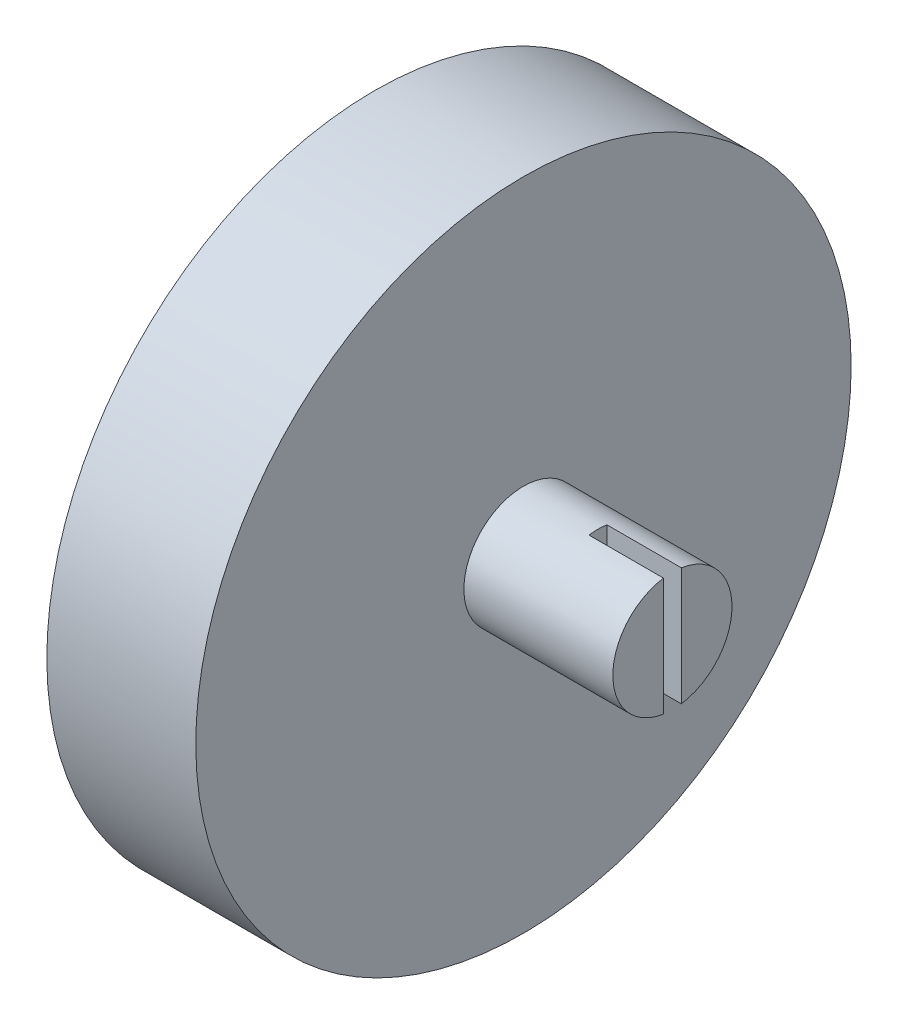
ISO-10303-21;
HEADER;
FILE_DESCRIPTION(('STEP AP214'),'2;1');
FILE_NAME('part.step','',(''),(''),'','','');
FILE_SCHEMA(('AUTOMOTIVE_DESIGN { 1 0 10303 214 1 1 1 1 }'));
ENDSEC;
DATA;
#1=APPLICATION_CONTEXT('core data for automotive mechanical design processes');
#2=APPLICATION_PROTOCOL_DEFINITION('international standard','automotive_design',2000,#1);
#3=PRODUCT_CONTEXT('',#1,'mechanical');
#4=PRODUCT('Part','Part','',(#3));
#5=PRODUCT_RELATED_PRODUCT_CATEGORY('part','',(#4));
#6=PRODUCT_DEFINITION_FORMATION('','',#4);
#7=PRODUCT_DEFINITION_CONTEXT('part definition',#1,'design');
#8=PRODUCT_DEFINITION('design','',#6,#7);
#9=PRODUCT_DEFINITION_SHAPE('','',#8);
#10=(LENGTH_UNIT() NAMED_UNIT(*) SI_UNIT(.MILLI.,.METRE.));
#11=(NAMED_UNIT(*) PLANE_ANGLE_UNIT() SI_UNIT($,.RADIAN.));
#12=(NAMED_UNIT(*) SI_UNIT($,.STERADIAN.) SOLID_ANGLE_UNIT());
#13=UNCERTAINTY_MEASURE_WITH_UNIT(LENGTH_MEASURE(1.E-05),#10,'distance_accuracy_value','');
#14=(GEOMETRIC_REPRESENTATION_CONTEXT(3) GLOBAL_UNCERTAINTY_ASSIGNED_CONTEXT((#13)) GLOBAL_UNIT_ASSIGNED_CONTEXT((#10,
#11,#12)) REPRESENTATION_CONTEXT('',''));
#15=CARTESIAN_POINT('',(0.,0.,0.));
#16=DIRECTION('',(0.,0.,1.));
#17=DIRECTION('',(1.,0.,0.));
#18=AXIS2_PLACEMENT_3D('',#15,#16,#17);
#19=CARTESIAN_POINT('',(5.5,19.5568517413347,6.50000000000001));
#20=DIRECTION('',(0.,0.,-1.));
#21=DIRECTION('',(0.,1.,0.));
#22=AXIS2_PLACEMENT_3D('',#19,#20,#21);
#23=PLANE('',#22);
#24=DIRECTION('',(-1.,0.,0.));
#25=VECTOR('',#24,1.);
#26=CARTESIAN_POINT('',(5.5,-6.94314825866529,6.5));
#27=LINE('',#26,#25);
#28=CARTESIAN_POINT('',(5.5,-6.94314825866529,6.5));
#29=VERTEX_POINT('',#28);
#30=CARTESIAN_POINT('',(4.25,-6.94314825866529,6.5));
#31=VERTEX_POINT('',#30);
#32=EDGE_CURVE('E470',#29,#31,#27,.T.);
#33=ORIENTED_EDGE('',*,*,#32,.T.);
#34=DIRECTION('',(0.,-1.,0.));
#35=VECTOR('',#34,1.);
#36=CARTESIAN_POINT('',(4.25,-5.94314825866529,6.5));
#37=LINE('',#36,#35);
#38=CARTESIAN_POINT('',(4.25,-5.94314825866529,6.5));
#39=VERTEX_POINT('',#38);
#40=EDGE_CURVE('E55',#39,#31,#37,.T.);
#41=ORIENTED_EDGE('',*,*,#40,.F.);
#42=DIRECTION('',(1.,0.,0.));
#43=VECTOR('',#42,1.);
#44=CARTESIAN_POINT('',(0.,-5.94314825866529,6.5));
#45=LINE('',#44,#43);
#46=CARTESIAN_POINT('',(3.,-5.94314825866529,6.5));
#47=VERTEX_POINT('',#46);
#48=EDGE_CURVE('E246',#47,#39,#45,.T.);
#49=ORIENTED_EDGE('',*,*,#48,.F.);
#50=DIRECTION('',(0.,1.,0.));
#51=VECTOR('',#50,1.);
#52=CARTESIAN_POINT('',(3.,19.5568517413347,6.50000000000001));
#53=LINE('',#52,#51);
#54=CARTESIAN_POINT('',(3.,17.1748906632346,6.50000000000001));
#55=VERTEX_POINT('',#54);
#56=EDGE_CURVE('E371',#47,#55,#53,.T.);
#57=ORIENTED_EDGE('',*,*,#56,.T.);
#58=DIRECTION('',(1.,0.,0.));
#59=VECTOR('',#58,1.);
#60=CARTESIAN_POINT('',(5.5,17.1748906632346,6.50000000000001));
#61=LINE('',#60,#59);
#62=CARTESIAN_POINT('',(0.,17.1748906632346,6.5));
#63=VERTEX_POINT('',#62);
#64=EDGE_CURVE('E384',#63,#55,#61,.T.);
#65=ORIENTED_EDGE('',*,*,#64,.F.);
#66=DIRECTION('',(0.,-1.,0.));
#67=VECTOR('',#66,1.);
#68=CARTESIAN_POINT('',(0.,19.5568517413347,6.50000000000001));
#69=LINE('',#68,#67);
#70=CARTESIAN_POINT('',(0.,19.5568517413347,6.50000000000001));
#71=VERTEX_POINT('',#70);
#72=EDGE_CURVE('E394',#71,#63,#69,.T.);
#73=ORIENTED_EDGE('',*,*,#72,.F.);
#74=DIRECTION('',(-1.,0.,0.));
#75=VECTOR('',#74,1.);
#76=CARTESIAN_POINT('',(5.5,19.5568517413347,6.50000000000001));
#77=LINE('',#76,#75);
#78=CARTESIAN_POINT('',(5.5,19.5568517413347,6.50000000000001));
#79=VERTEX_POINT('',#78);
#80=EDGE_CURVE('E466',#79,#71,#77,.T.);
#81=ORIENTED_EDGE('',*,*,#80,.F.);
#82=DIRECTION('',(0.,-1.,0.));
#83=VECTOR('',#82,1.);
#84=CARTESIAN_POINT('',(5.5,19.5568517413347,6.50000000000001));
#85=LINE('',#84,#83);
#86=EDGE_CURVE('E427',#79,#29,#85,.T.);
#87=ORIENTED_EDGE('',*,*,#86,.T.);
#88=EDGE_LOOP('',(#33,#41,#49,#57,#65,#73,#81,#87));
#89=FACE_BOUND('',#88,.T.);
#90=ADVANCED_FACE('F39',(#89),#23,.T.);
#91=CARTESIAN_POINT('',(5.5,-6.94314825866529,6.5));
#92=DIRECTION('',(0.,1.,0.));
#93=DIRECTION('',(0.,0.,1.));
#94=AXIS2_PLACEMENT_3D('',#91,#92,#93);
#95=PLANE('',#94);
#96=DIRECTION('',(0.,0.,1.));
#97=VECTOR('',#96,1.);
#98=CARTESIAN_POINT('',(3.,-6.9431482586653,9.00000000000001));
#99=LINE('',#98,#97);
#100=CARTESIAN_POINT('',(3.,-6.9431482586653,6.5));
#101=VERTEX_POINT('',#100);
#102=CARTESIAN_POINT('',(3.,-6.9431482586653,9.00000000000001));
#103=VERTEX_POINT('',#102);
#104=EDGE_CURVE('E340',#101,#103,#99,.T.);
#105=ORIENTED_EDGE('',*,*,#104,.F.);
#106=DIRECTION('',(1.,0.,0.));
#107=VECTOR('',#106,1.);
#108=CARTESIAN_POINT('',(0.,-6.94314825866529,6.5));
#109=LINE('',#108,#107);
#110=CARTESIAN_POINT('',(0.,-6.94314825866529,6.5));
#111=VERTEX_POINT('',#110);
#112=EDGE_CURVE('E693',#111,#101,#109,.T.);
#113=ORIENTED_EDGE('',*,*,#112,.F.);
#114=DIRECTION('',(0.,0.,-1.));
#115=VECTOR('',#114,1.);
#116=CARTESIAN_POINT('',(0.,-6.94314825866529,6.5));
#117=LINE('',#116,#115);
#118=CARTESIAN_POINT('',(0.,-6.9431482586653,9.00000000000001));
#119=VERTEX_POINT('',#118);
#120=EDGE_CURVE('E262',#119,#111,#117,.T.);
#121=ORIENTED_EDGE('',*,*,#120,.F.);
#122=DIRECTION('',(-1.,0.,0.));
#123=VECTOR('',#122,1.);
#124=CARTESIAN_POINT('',(3.,-6.9431482586653,9.00000000000001));
#125=LINE('',#124,#123);
#126=EDGE_CURVE('E375',#103,#119,#125,.T.);
#127=ORIENTED_EDGE('',*,*,#126,.F.);
#128=EDGE_LOOP('',(#105,#113,#121,#127));
#129=FACE_BOUND('',#128,.T.);
#130=ADVANCED_FACE('F628',(#129),#95,.T.);
#131=DIRECTION('',(-1.,0.,0.));
#132=VECTOR('',#131,1.);
#133=CARTESIAN_POINT('',(5.5,-6.94314825866529,4.76239289224447));
#134=LINE('',#133,#132);
#135=CARTESIAN_POINT('',(5.5,-6.94314825866529,4.76239289224447));
#136=VERTEX_POINT('',#135);
#137=CARTESIAN_POINT('',(4.25,-6.94314825866529,4.76239289224447));
#138=VERTEX_POINT('',#137);
#139=EDGE_CURVE('E473',#136,#138,#134,.T.);
#140=ORIENTED_EDGE('',*,*,#139,.T.);
#141=DIRECTION('',(0.,0.,-1.));
#142=VECTOR('',#141,1.);
#143=CARTESIAN_POINT('',(4.25,-6.94314825866529,4.76239289224447));
#144=LINE('',#143,#142);
#145=EDGE_CURVE('E63',#31,#138,#144,.T.);
#146=ORIENTED_EDGE('',*,*,#145,.F.);
#147=ORIENTED_EDGE('',*,*,#32,.F.);
#148=DIRECTION('',(0.,0.,-1.));
#149=VECTOR('',#148,1.);
#150=CARTESIAN_POINT('',(5.5,-6.94314825866529,6.5));
#151=LINE('',#150,#149);
#152=EDGE_CURVE('E424',#29,#136,#151,.T.);
#153=ORIENTED_EDGE('',*,*,#152,.T.);
#154=EDGE_LOOP('',(#140,#146,#147,#153));
#155=FACE_BOUND('',#154,.T.);
#156=ADVANCED_FACE('F633',(#155),#95,.T.);
#157=CARTESIAN_POINT('',(5.5,-6.94314825866529,-6.5));
#158=DIRECTION('',(0.,-1.,0.));
#159=DIRECTION('',(0.,0.,-1.));
#160=AXIS2_PLACEMENT_3D('',#157,#158,#159);
#161=PLANE('',#160);
#162=DIRECTION('',(0.,0.,-1.));
#163=VECTOR('',#162,1.);
#164=CARTESIAN_POINT('',(4.,-6.94314825866529,-6.51239289224447));
#165=LINE('',#164,#163);
#166=CARTESIAN_POINT('',(4.,-6.94314825866529,-4.76239289224447));
#167=VERTEX_POINT('',#166);
#168=CARTESIAN_POINT('',(4.,-6.94314825866529,-6.5));
#169=VERTEX_POINT('',#168);
#170=EDGE_CURVE('E264',#167,#169,#165,.T.);
#171=ORIENTED_EDGE('',*,*,#170,.F.);
#172=DIRECTION('',(-1.,0.,0.));
#173=VECTOR('',#172,1.);
#174=CARTESIAN_POINT('',(5.5,-6.94314825866529,-4.76239289224447));
#175=LINE('',#174,#173);
#176=CARTESIAN_POINT('',(5.5,-6.94314825866529,-4.76239289224447));
#177=VERTEX_POINT('',#176);
#178=EDGE_CURVE('E495',#177,#167,#175,.T.);
#179=ORIENTED_EDGE('',*,*,#178,.F.);
#180=DIRECTION('',(0.,0.,1.));
#181=VECTOR('',#180,1.);
#182=CARTESIAN_POINT('',(5.5,-6.94314825866529,-6.5));
#183=LINE('',#182,#181);
#184=CARTESIAN_POINT('',(5.5,-6.94314825866529,-6.5));
#185=VERTEX_POINT('',#184);
#186=EDGE_CURVE('E398',#185,#177,#183,.T.);
#187=ORIENTED_EDGE('',*,*,#186,.F.);
#188=DIRECTION('',(-1.,0.,0.));
#189=VECTOR('',#188,1.);
#190=CARTESIAN_POINT('',(5.5,-6.94314825866529,-6.5));
#191=LINE('',#190,#189);
#192=EDGE_CURVE('E499',#185,#169,#191,.T.);
#193=ORIENTED_EDGE('',*,*,#192,.T.);
#194=EDGE_LOOP('',(#171,#179,#187,#193));
#195=FACE_BOUND('',#194,.T.);
#196=ADVANCED_FACE('F564',(#195),#161,.F.);
#197=DIRECTION('',(-1.,0.,0.));
#198=VECTOR('',#197,1.);
#199=CARTESIAN_POINT('',(0.,-6.94314825866529,-6.51239289224447));
#200=LINE('',#199,#198);
#201=CARTESIAN_POINT('',(3.,-6.94314825866529,-6.51239289224447));
#202=VERTEX_POINT('',#201);
#203=CARTESIAN_POINT('',(0.,-6.94314825866529,-6.51239289224447));
#204=VERTEX_POINT('',#203);
#205=EDGE_CURVE('E268',#202,#204,#200,.T.);
#206=ORIENTED_EDGE('',*,*,#205,.F.);
#207=CARTESIAN_POINT('',(3.,-6.9431482586653,-9.));
#208=VERTEX_POINT('',#207);
#209=EDGE_CURVE('E342',#208,#202,#99,.T.);
#210=ORIENTED_EDGE('',*,*,#209,.F.);
#211=DIRECTION('',(-1.,0.,0.));
#212=VECTOR('',#211,1.);
#213=CARTESIAN_POINT('',(3.,-6.9431482586653,-9.));
#214=LINE('',#213,#212);
#215=CARTESIAN_POINT('',(0.,-6.9431482586653,-9.));
#216=VERTEX_POINT('',#215);
#217=EDGE_CURVE('E355',#208,#216,#214,.T.);
#218=ORIENTED_EDGE('',*,*,#217,.T.);
#219=DIRECTION('',(0.,0.,1.));
#220=VECTOR('',#219,1.);
#221=CARTESIAN_POINT('',(0.,-6.94314825866529,-6.5));
#222=LINE('',#221,#220);
#223=EDGE_CURVE('E437',#216,#204,#222,.T.);
#224=ORIENTED_EDGE('',*,*,#223,.T.);
#225=EDGE_LOOP('',(#206,#210,#218,#224));
#226=FACE_BOUND('',#225,.T.);
#227=ADVANCED_FACE('F546',(#226),#161,.F.);
#228=CARTESIAN_POINT('',(5.5,19.5568517413347,-6.49999999999999));
#229=DIRECTION('',(0.,0.,-1.));
#230=DIRECTION('',(0.,1.,0.));
#231=AXIS2_PLACEMENT_3D('',#228,#229,#230);
#232=PLANE('',#231);
#233=DIRECTION('',(0.,1.,0.));
#234=VECTOR('',#233,1.);
#235=CARTESIAN_POINT('',(4.,19.5568517413347,-6.49999999999999));
#236=LINE('',#235,#234);
#237=CARTESIAN_POINT('',(4.,-5.94314825866529,-6.5));
#238=VERTEX_POINT('',#237);
#239=EDGE_CURVE('E11',#169,#238,#236,.T.);
#240=ORIENTED_EDGE('',*,*,#239,.F.);
#241=ORIENTED_EDGE('',*,*,#192,.F.);
#242=DIRECTION('',(0.,-1.,0.));
#243=VECTOR('',#242,1.);
#244=CARTESIAN_POINT('',(5.5,19.5568517413347,-6.49999999999999));
#245=LINE('',#244,#243);
#246=CARTESIAN_POINT('',(5.5,19.5568517413347,-6.49999999999999));
#247=VERTEX_POINT('',#246);
#248=EDGE_CURVE('E393',#247,#185,#245,.T.);
#249=ORIENTED_EDGE('',*,*,#248,.F.);
#250=DIRECTION('',(-1.,0.,0.));
#251=VECTOR('',#250,1.);
#252=CARTESIAN_POINT('',(5.5,19.5568517413347,-6.49999999999999));
#253=LINE('',#252,#251);
#254=CARTESIAN_POINT('',(0.,19.5568517413347,-6.49999999999999));
#255=VERTEX_POINT('',#254);
#256=EDGE_CURVE('E430',#247,#255,#253,.T.);
#257=ORIENTED_EDGE('',*,*,#256,.T.);
#258=DIRECTION('',(0.,-1.,0.));
#259=VECTOR('',#258,1.);
#260=CARTESIAN_POINT('',(0.,19.5568517413347,-6.49999999999999));
#261=LINE('',#260,#259);
#262=CARTESIAN_POINT('',(0.,17.1748906632345,-6.5));
#263=VERTEX_POINT('',#262);
#264=EDGE_CURVE('E433',#255,#263,#261,.T.);
#265=ORIENTED_EDGE('',*,*,#264,.T.);
#266=DIRECTION('',(1.,0.,0.));
#267=VECTOR('',#266,1.);
#268=CARTESIAN_POINT('',(5.5,17.1748906632345,-6.49999999999999));
#269=LINE('',#268,#267);
#270=CARTESIAN_POINT('',(3.,17.1748906632345,-6.5));
#271=VERTEX_POINT('',#270);
#272=EDGE_CURVE('E335',#263,#271,#269,.T.);
#273=ORIENTED_EDGE('',*,*,#272,.T.);
#274=DIRECTION('',(0.,1.,0.));
#275=VECTOR('',#274,1.);
#276=CARTESIAN_POINT('',(3.,19.5568517413347,-6.49999999999999));
#277=LINE('',#276,#275);
#278=CARTESIAN_POINT('',(3.,-5.94314825866529,-6.5));
#279=VERTEX_POINT('',#278);
#280=EDGE_CURVE('E516',#279,#271,#277,.T.);
#281=ORIENTED_EDGE('',*,*,#280,.F.);
#282=DIRECTION('',(-1.,0.,0.));
#283=VECTOR('',#282,1.);
#284=CARTESIAN_POINT('',(5.5,-5.94314825866529,-6.5));
#285=LINE('',#284,#283);
#286=EDGE_CURVE('E298',#238,#279,#285,.T.);
#287=ORIENTED_EDGE('',*,*,#286,.F.);
#288=EDGE_LOOP('',(#240,#241,#249,#257,#265,#273,#281,#287));
#289=FACE_BOUND('',#288,.T.);
#290=ADVANCED_FACE('F568',(#289),#232,.F.);
#291=CARTESIAN_POINT('',(3.,0.,0.));
#292=DIRECTION('',(-1.,0.,0.));
#293=DIRECTION('',(0.,0.,1.));
#294=AXIS2_PLACEMENT_3D('',#291,#292,#293);
#295=PLANE('',#294);
#296=ORIENTED_EDGE('',*,*,#209,.T.);
#297=DIRECTION('',(0.,1.,0.));
#298=VECTOR('',#297,1.);
#299=CARTESIAN_POINT('',(3.,0.,-6.51239289224447));
#300=LINE('',#299,#298);
#301=CARTESIAN_POINT('',(3.,-5.94314825866529,-6.51239289224447));
#302=VERTEX_POINT('',#301);
#303=EDGE_CURVE('E48',#202,#302,#300,.T.);
#304=ORIENTED_EDGE('',*,*,#303,.T.);
#305=DIRECTION('',(0.,0.,1.));
#306=VECTOR('',#305,1.);
#307=CARTESIAN_POINT('',(3.,-5.94314825866529,0.));
#308=LINE('',#307,#306);
#309=EDGE_CURVE('E531',#302,#279,#308,.T.);
#310=ORIENTED_EDGE('',*,*,#309,.T.);
#311=ORIENTED_EDGE('',*,*,#280,.T.);
#312=DIRECTION('',(0.,0.,-1.));
#313=VECTOR('',#312,1.);
#314=CARTESIAN_POINT('',(3.,17.1748906632346,9.));
#315=LINE('',#314,#313);
#316=CARTESIAN_POINT('',(3.,17.1748906632345,-9.00000000000001));
#317=VERTEX_POINT('',#316);
#318=EDGE_CURVE('E350',#271,#317,#315,.T.);
#319=ORIENTED_EDGE('',*,*,#318,.T.);
#320=DIRECTION('',(0.,-1.,0.));
#321=VECTOR('',#320,1.);
#322=CARTESIAN_POINT('',(3.,-6.9431482586653,-9.));
#323=LINE('',#322,#321);
#324=EDGE_CURVE('E336',#317,#208,#323,.T.);
#325=ORIENTED_EDGE('',*,*,#324,.T.);
#326=EDGE_LOOP('',(#296,#304,#310,#311,#319,#325));
#327=FACE_BOUND('',#326,.T.);
#328=ADVANCED_FACE('F537',(#327),#295,.T.);
#329=CARTESIAN_POINT('',(20.,0.,0.));
#330=DIRECTION('',(1.,0.,0.));
#331=DIRECTION('',(0.,0.,-1.));
#332=AXIS2_PLACEMENT_3D('',#329,#330,#331);
#333=PLANE('',#332);
#334=DIRECTION('',(0.,-1.,0.));
#335=VECTOR('',#334,1.);
#336=CARTESIAN_POINT('',(20.,0.,0.6));
#337=LINE('',#336,#335);
#338=CARTESIAN_POINT('',(20.,3.95474398665704,0.600000000000001));
#339=VERTEX_POINT('',#338);
#340=CARTESIAN_POINT('',(20.,-3.95474398665704,0.6));
#341=VERTEX_POINT('',#340);
#342=EDGE_CURVE('E524',#339,#341,#337,.T.);
#343=ORIENTED_EDGE('',*,*,#342,.F.);
#344=CARTESIAN_POINT('',(20.,0.,0.));
#345=DIRECTION('',(1.,0.,0.));
#346=DIRECTION('',(0.,0.,-1.));
#347=AXIS2_PLACEMENT_3D('',#344,#345,#346);
#348=CIRCLE('',#347,4.);
#349=EDGE_CURVE('E329',#339,#341,#348,.T.);
#350=ORIENTED_EDGE('',*,*,#349,.T.);
#351=EDGE_LOOP('',(#343,#350));
#352=FACE_BOUND('',#351,.T.);
#353=ADVANCED_FACE('F583',(#352),#333,.T.);
#354=CARTESIAN_POINT('',(10.,0.,0.));
#355=DIRECTION('',(-1.,0.,0.));
#356=DIRECTION('',(0.,0.,1.));
#357=AXIS2_PLACEMENT_3D('',#354,#355,#356);
#358=CYLINDRICAL_SURFACE('',#357,22.);
#359=CARTESIAN_POINT('',(0.,0.,0.));
#360=DIRECTION('',(1.,0.,0.));
#361=DIRECTION('',(0.,0.,-1.));
#362=AXIS2_PLACEMENT_3D('',#359,#360,#361);
#363=CIRCLE('',#362,22.);
#364=CARTESIAN_POINT('',(0.,-21.837327130716,-2.67042015160433));
#365=VERTEX_POINT('',#364);
#366=CARTESIAN_POINT('',(0.,-21.837327130716,2.67042015160434));
#367=VERTEX_POINT('',#366);
#368=EDGE_CURVE('E469',#365,#367,#363,.T.);
#369=ORIENTED_EDGE('',*,*,#368,.T.);
#370=DIRECTION('',(-1.,0.,0.));
#371=VECTOR('',#370,1.);
#372=CARTESIAN_POINT('',(5.5,-21.837327130716,2.67042015160434));
#373=LINE('',#372,#371);
#374=CARTESIAN_POINT('',(5.5,-21.837327130716,2.67042015160434));
#375=VERTEX_POINT('',#374);
#376=EDGE_CURVE('E482',#375,#367,#373,.T.);
#377=ORIENTED_EDGE('',*,*,#376,.F.);
#378=CARTESIAN_POINT('',(5.5,0.,0.));
#379=DIRECTION('',(1.,0.,0.));
#380=DIRECTION('',(0.,0.,-1.));
#381=AXIS2_PLACEMENT_3D('',#378,#379,#380);
#382=CIRCLE('',#381,22.);
#383=CARTESIAN_POINT('',(5.5,-21.837327130716,-2.67042015160433));
#384=VERTEX_POINT('',#383);
#385=EDGE_CURVE('E510',#375,#384,#382,.T.);
#386=ORIENTED_EDGE('',*,*,#385,.T.);
#387=DIRECTION('',(-1.,0.,0.));
#388=VECTOR('',#387,1.);
#389=CARTESIAN_POINT('',(5.5,-21.837327130716,-2.67042015160433));
#390=LINE('',#389,#388);
#391=EDGE_CURVE('E485',#384,#365,#390,.T.);
#392=ORIENTED_EDGE('',*,*,#391,.T.);
#393=EDGE_LOOP('',(#369,#377,#386,#392));
#394=FACE_BOUND('',#393,.T.);
#395=CARTESIAN_POINT('',(10.,0.,0.));
#396=DIRECTION('',(1.,0.,0.));
#397=DIRECTION('',(0.,0.,-1.));
#398=AXIS2_PLACEMENT_3D('',#395,#396,#397);
#399=CIRCLE('',#398,22.);
#400=CARTESIAN_POINT('',(10.,0.,-22.));
#401=VERTEX_POINT('',#400);
#402=EDGE_CURVE('E506',#401,#401,#399,.T.);
#403=ORIENTED_EDGE('',*,*,#402,.F.);
#404=EDGE_LOOP('',(#403));
#405=FACE_BOUND('',#404,.T.);
#406=ADVANCED_FACE('F41',(#394,#405),#358,.T.);
#407=CARTESIAN_POINT('',(10.,0.,0.));
#408=DIRECTION('',(1.,0.,0.));
#409=DIRECTION('',(0.,0.,-1.));
#410=AXIS2_PLACEMENT_3D('',#407,#408,#409);
#411=PLANE('',#410);
#412=CARTESIAN_POINT('',(10.,0.,0.));
#413=DIRECTION('',(1.,0.,0.));
#414=DIRECTION('',(0.,0.,-1.));
#415=AXIS2_PLACEMENT_3D('',#412,#413,#414);
#416=CIRCLE('',#415,4.);
#417=CARTESIAN_POINT('',(10.,0.,-4.));
#418=VERTEX_POINT('',#417);
#419=EDGE_CURVE('E330',#418,#418,#416,.T.);
#420=ORIENTED_EDGE('',*,*,#419,.F.);
#421=EDGE_LOOP('',(#420));
#422=FACE_BOUND('',#421,.T.);
#423=ORIENTED_EDGE('',*,*,#402,.T.);
#424=EDGE_LOOP('',(#423));
#425=FACE_BOUND('',#424,.T.);
#426=ADVANCED_FACE('F665',(#422,#425),#411,.T.);
#427=CARTESIAN_POINT('',(0.,0.,0.));
#428=DIRECTION('',(1.,0.,0.));
#429=DIRECTION('',(0.,0.,-1.));
#430=AXIS2_PLACEMENT_3D('',#427,#428,#429);
#431=PLANE('',#430);
#432=CARTESIAN_POINT('',(0.,0.,14.));
#433=DIRECTION('',(1.,0.,0.));
#434=DIRECTION('',(0.,0.,-1.));
#435=AXIS2_PLACEMENT_3D('',#432,#433,#434);
#436=CIRCLE('',#435,1.5);
#437=CARTESIAN_POINT('',(0.,0.,12.5));
#438=VERTEX_POINT('',#437);
#439=EDGE_CURVE('E676',#438,#438,#436,.T.);
#440=ORIENTED_EDGE('',*,*,#439,.T.);
#441=EDGE_LOOP('',(#440));
#442=FACE_BOUND('',#441,.T.);
#443=CARTESIAN_POINT('',(0.,0.,-14.));
#444=DIRECTION('',(1.,0.,0.));
#445=DIRECTION('',(0.,0.,-1.));
#446=AXIS2_PLACEMENT_3D('',#443,#444,#445);
#447=CIRCLE('',#446,1.5);
#448=CARTESIAN_POINT('',(0.,0.,-15.5));
#449=VERTEX_POINT('',#448);
#450=EDGE_CURVE('E679',#449,#449,#447,.T.);
#451=ORIENTED_EDGE('',*,*,#450,.T.);
#452=EDGE_LOOP('',(#451));
#453=FACE_BOUND('',#452,.T.);
#454=ORIENTED_EDGE('',*,*,#72,.T.);
#455=DIRECTION('',(0.,0.,-1.));
#456=VECTOR('',#455,1.);
#457=CARTESIAN_POINT('',(0.,17.1748906632346,9.));
#458=LINE('',#457,#456);
#459=CARTESIAN_POINT('',(0.,17.1748906632346,9.));
#460=VERTEX_POINT('',#459);
#461=EDGE_CURVE('E341',#460,#63,#458,.T.);
#462=ORIENTED_EDGE('',*,*,#461,.F.);
#463=DIRECTION('',(0.,1.,0.));
#464=VECTOR('',#463,1.);
#465=CARTESIAN_POINT('',(0.,17.1748906632346,9.));
#466=LINE('',#465,#464);
#467=EDGE_CURVE('E360',#119,#460,#466,.T.);
#468=ORIENTED_EDGE('',*,*,#467,.F.);
#469=ORIENTED_EDGE('',*,*,#120,.T.);
#470=DIRECTION('',(0.,-1.,0.));
#471=VECTOR('',#470,1.);
#472=CARTESIAN_POINT('',(0.,-5.94314825866529,6.5));
#473=LINE('',#472,#471);
#474=CARTESIAN_POINT('',(0.,-5.94314825866529,6.5));
#475=VERTEX_POINT('',#474);
#476=EDGE_CURVE('E241',#475,#111,#473,.T.);
#477=ORIENTED_EDGE('',*,*,#476,.F.);
#478=DIRECTION('',(0.,0.,1.));
#479=VECTOR('',#478,1.);
#480=CARTESIAN_POINT('',(0.,-5.94314825866529,4.76239289224447));
#481=LINE('',#480,#479);
#482=CARTESIAN_POINT('',(0.,-5.94314825866529,4.76239289224447));
#483=VERTEX_POINT('',#482);
#484=EDGE_CURVE('E250',#483,#475,#481,.T.);
#485=ORIENTED_EDGE('',*,*,#484,.F.);
#486=DIRECTION('',(0.,1.,0.));
#487=VECTOR('',#486,1.);
#488=CARTESIAN_POINT('',(0.,-10.,4.76239289224447));
#489=LINE('',#488,#487);
#490=CARTESIAN_POINT('',(0.,-10.,4.76239289224447));
#491=VERTEX_POINT('',#490);
#492=EDGE_CURVE('E459',#491,#483,#489,.T.);
#493=ORIENTED_EDGE('',*,*,#492,.F.);
#494=DIRECTION('',(0.,-0.952328688194239,-0.305073875712489));
#495=VECTOR('',#494,1.);
#496=CARTESIAN_POINT('',(0.,-10.,4.76239289224447));
#497=LINE('',#496,#495);
#498=CARTESIAN_POINT('',(0.,-16.5303712131336,2.67042015160433));
#499=VERTEX_POINT('',#498);
#500=EDGE_CURVE('E455',#491,#499,#497,.T.);
#501=ORIENTED_EDGE('',*,*,#500,.T.);
#502=DIRECTION('',(0.,1.,0.));
#503=VECTOR('',#502,1.);
#504=CARTESIAN_POINT('',(0.,-16.8581606699215,2.67042015160433));
#505=LINE('',#504,#503);
#506=EDGE_CURVE('E451',#367,#499,#505,.T.);
#507=ORIENTED_EDGE('',*,*,#506,.F.);
#508=ORIENTED_EDGE('',*,*,#368,.F.);
#509=DIRECTION('',(0.,-1.,0.));
#510=VECTOR('',#509,1.);
#511=CARTESIAN_POINT('',(0.,-16.8581606699215,-2.67042015160433));
#512=LINE('',#511,#510);
#513=CARTESIAN_POINT('',(0.,-16.5303712131336,-2.67042015160434));
#514=VERTEX_POINT('',#513);
#515=EDGE_CURVE('E448',#514,#365,#512,.T.);
#516=ORIENTED_EDGE('',*,*,#515,.F.);
#517=DIRECTION('',(0.,-0.95232868819424,0.305073875712488));
#518=VECTOR('',#517,1.);
#519=CARTESIAN_POINT('',(0.,-10.,-4.76239289224447));
#520=LINE('',#519,#518);
#521=CARTESIAN_POINT('',(0.,-10.,-4.76239289224447));
#522=VERTEX_POINT('',#521);
#523=EDGE_CURVE('E444',#522,#514,#520,.T.);
#524=ORIENTED_EDGE('',*,*,#523,.F.);
#525=DIRECTION('',(0.,1.,0.));
#526=VECTOR('',#525,1.);
#527=CARTESIAN_POINT('',(0.,-10.,-4.76239289224447));
#528=LINE('',#527,#526);
#529=CARTESIAN_POINT('',(0.,-5.94314825866529,-4.76239289224447));
#530=VERTEX_POINT('',#529);
#531=EDGE_CURVE('E441',#522,#530,#528,.T.);
#532=ORIENTED_EDGE('',*,*,#531,.T.);
#533=DIRECTION('',(0.,0.,1.));
#534=VECTOR('',#533,1.);
#535=CARTESIAN_POINT('',(0.,-5.94314825866529,-4.76239289224447));
#536=LINE('',#535,#534);
#537=CARTESIAN_POINT('',(0.,-5.94314825866529,-6.51239289224447));
#538=VERTEX_POINT('',#537);
#539=EDGE_CURVE('E285',#538,#530,#536,.T.);
#540=ORIENTED_EDGE('',*,*,#539,.F.);
#541=DIRECTION('',(0.,-1.,0.));
#542=VECTOR('',#541,1.);
#543=CARTESIAN_POINT('',(0.,-5.94314825866529,-6.51239289224447));
#544=LINE('',#543,#542);
#545=EDGE_CURVE('E288',#538,#204,#544,.T.);
#546=ORIENTED_EDGE('',*,*,#545,.T.);
#547=ORIENTED_EDGE('',*,*,#223,.F.);
#548=DIRECTION('',(0.,-1.,0.));
#549=VECTOR('',#548,1.);
#550=CARTESIAN_POINT('',(0.,-6.9431482586653,-9.));
#551=LINE('',#550,#549);
#552=CARTESIAN_POINT('',(0.,17.1748906632345,-9.00000000000001));
#553=VERTEX_POINT('',#552);
#554=EDGE_CURVE('E356',#553,#216,#551,.T.);
#555=ORIENTED_EDGE('',*,*,#554,.F.);
#556=EDGE_CURVE('E364',#263,#553,#458,.T.);
#557=ORIENTED_EDGE('',*,*,#556,.F.);
#558=ORIENTED_EDGE('',*,*,#264,.F.);
#559=DIRECTION('',(0.,0.,-1.));
#560=VECTOR('',#559,1.);
#561=CARTESIAN_POINT('',(0.,19.5568517413347,6.50000000000001));
#562=LINE('',#561,#560);
#563=EDGE_CURVE('E388',#71,#255,#562,.T.);
#564=ORIENTED_EDGE('',*,*,#563,.F.);
#565=EDGE_LOOP('',(#454,#462,#468,#469,#477,#485,#493,#501,#507,#508,#516,#524,#532,#540,#546,
#547,#555,#557,#558,#564));
#566=FACE_BOUND('',#565,.T.);
#567=ADVANCED_FACE('F260',(#442,#453,#566),#431,.F.);
#568=CARTESIAN_POINT('',(5.5,0.,0.));
#569=DIRECTION('',(1.,0.,0.));
#570=DIRECTION('',(0.,0.,-1.));
#571=AXIS2_PLACEMENT_3D('',#568,#569,#570);
#572=PLANE('',#571);
#573=ORIENTED_EDGE('',*,*,#385,.F.);
#574=DIRECTION('',(0.,-1.,0.));
#575=VECTOR('',#574,1.);
#576=CARTESIAN_POINT('',(5.5,-16.8581606699215,2.67042015160433));
#577=LINE('',#576,#575);
#578=CARTESIAN_POINT('',(5.5,-16.5303712131336,2.67042015160433));
#579=VERTEX_POINT('',#578);
#580=EDGE_CURVE('E412',#579,#375,#577,.T.);
#581=ORIENTED_EDGE('',*,*,#580,.F.);
#582=DIRECTION('',(0.,-0.952328688194239,-0.305073875712489));
#583=VECTOR('',#582,1.);
#584=CARTESIAN_POINT('',(5.5,-10.,4.76239289224447));
#585=LINE('',#584,#583);
#586=CARTESIAN_POINT('',(5.5,-10.,4.76239289224447));
#587=VERTEX_POINT('',#586);
#588=EDGE_CURVE('E416',#587,#579,#585,.T.);
#589=ORIENTED_EDGE('',*,*,#588,.F.);
#590=DIRECTION('',(0.,1.,0.));
#591=VECTOR('',#590,1.);
#592=CARTESIAN_POINT('',(5.5,-10.,4.76239289224447));
#593=LINE('',#592,#591);
#594=EDGE_CURVE('E420',#587,#136,#593,.T.);
#595=ORIENTED_EDGE('',*,*,#594,.T.);
#596=ORIENTED_EDGE('',*,*,#152,.F.);
#597=ORIENTED_EDGE('',*,*,#86,.F.);
#598=DIRECTION('',(0.,0.,-1.));
#599=VECTOR('',#598,1.);
#600=CARTESIAN_POINT('',(5.5,19.5568517413347,6.50000000000001));
#601=LINE('',#600,#599);
#602=EDGE_CURVE('E389',#79,#247,#601,.T.);
#603=ORIENTED_EDGE('',*,*,#602,.T.);
#604=ORIENTED_EDGE('',*,*,#248,.T.);
#605=ORIENTED_EDGE('',*,*,#186,.T.);
#606=DIRECTION('',(0.,1.,0.));
#607=VECTOR('',#606,1.);
#608=CARTESIAN_POINT('',(5.5,-10.,-4.76239289224447));
#609=LINE('',#608,#607);
#610=CARTESIAN_POINT('',(5.5,-10.,-4.76239289224447));
#611=VERTEX_POINT('',#610);
#612=EDGE_CURVE('E402',#611,#177,#609,.T.);
#613=ORIENTED_EDGE('',*,*,#612,.F.);
#614=DIRECTION('',(0.,-0.95232868819424,0.305073875712488));
#615=VECTOR('',#614,1.);
#616=CARTESIAN_POINT('',(5.5,-10.,-4.76239289224447));
#617=LINE('',#616,#615);
#618=CARTESIAN_POINT('',(5.5,-16.5303712131336,-2.67042015160434));
#619=VERTEX_POINT('',#618);
#620=EDGE_CURVE('E405',#611,#619,#617,.T.);
#621=ORIENTED_EDGE('',*,*,#620,.T.);
#622=DIRECTION('',(0.,1.,0.));
#623=VECTOR('',#622,1.);
#624=CARTESIAN_POINT('',(5.5,-16.8581606699215,-2.67042015160433));
#625=LINE('',#624,#623);
#626=EDGE_CURVE('E409',#384,#619,#625,.T.);
#627=ORIENTED_EDGE('',*,*,#626,.F.);
#628=EDGE_LOOP('',(#573,#581,#589,#595,#596,#597,#603,#604,#605,#613,#621,#627));
#629=FACE_BOUND('',#628,.T.);
#630=ADVANCED_FACE('F613',(#629),#572,.F.);
#631=CARTESIAN_POINT('',(5.5,19.5568517413347,6.50000000000001));
#632=DIRECTION('',(0.,1.,0.));
#633=DIRECTION('',(0.,0.,1.));
#634=AXIS2_PLACEMENT_3D('',#631,#632,#633);
#635=PLANE('',#634);
#636=ORIENTED_EDGE('',*,*,#563,.T.);
#637=ORIENTED_EDGE('',*,*,#256,.F.);
#638=ORIENTED_EDGE('',*,*,#602,.F.);
#639=ORIENTED_EDGE('',*,*,#80,.T.);
#640=EDGE_LOOP('',(#636,#637,#638,#639));
#641=FACE_BOUND('',#640,.T.);
#642=ADVANCED_FACE('F614',(#641),#635,.F.);
#643=CARTESIAN_POINT('',(5.5,-10.,4.76239289224447));
#644=DIRECTION('',(0.,0.,1.));
#645=DIRECTION('',(1.,0.,0.));
#646=AXIS2_PLACEMENT_3D('',#643,#644,#645);
#647=PLANE('',#646);
#648=ORIENTED_EDGE('',*,*,#492,.T.);
#649=DIRECTION('',(-1.,0.,0.));
#650=VECTOR('',#649,1.);
#651=CARTESIAN_POINT('',(0.,-5.94314825866529,4.76239289224447));
#652=LINE('',#651,#650);
#653=CARTESIAN_POINT('',(4.25,-5.94314825866529,4.76239289224447));
#654=VERTEX_POINT('',#653);
#655=EDGE_CURVE('E253',#654,#483,#652,.T.);
#656=ORIENTED_EDGE('',*,*,#655,.F.);
#657=DIRECTION('',(0.,-1.,0.));
#658=VECTOR('',#657,1.);
#659=CARTESIAN_POINT('',(4.25,-5.94314825866529,4.76239289224447));
#660=LINE('',#659,#658);
#661=EDGE_CURVE('E270',#654,#138,#660,.T.);
#662=ORIENTED_EDGE('',*,*,#661,.T.);
#663=ORIENTED_EDGE('',*,*,#139,.F.);
#664=ORIENTED_EDGE('',*,*,#594,.F.);
#665=DIRECTION('',(-1.,0.,0.));
#666=VECTOR('',#665,1.);
#667=CARTESIAN_POINT('',(5.5,-10.,4.76239289224447));
#668=LINE('',#667,#666);
#669=EDGE_CURVE('E476',#587,#491,#668,.T.);
#670=ORIENTED_EDGE('',*,*,#669,.T.);
#671=EDGE_LOOP('',(#648,#656,#662,#663,#664,#670));
#672=FACE_BOUND('',#671,.T.);
#673=ADVANCED_FACE('F637',(#672),#647,.F.);
#674=CARTESIAN_POINT('',(5.5,-10.,4.76239289224447));
#675=DIRECTION('',(0.,0.305073875712489,-0.952328688194239));
#676=DIRECTION('',(0.,0.952328688194239,0.305073875712489));
#677=AXIS2_PLACEMENT_3D('',#674,#675,#676);
#678=PLANE('',#677);
#679=ORIENTED_EDGE('',*,*,#500,.F.);
#680=ORIENTED_EDGE('',*,*,#669,.F.);
#681=ORIENTED_EDGE('',*,*,#588,.T.);
#682=DIRECTION('',(-1.,0.,0.));
#683=VECTOR('',#682,1.);
#684=CARTESIAN_POINT('',(5.5,-16.5303712131336,2.67042015160433));
#685=LINE('',#684,#683);
#686=EDGE_CURVE('E479',#579,#499,#685,.T.);
#687=ORIENTED_EDGE('',*,*,#686,.T.);
#688=EDGE_LOOP('',(#679,#680,#681,#687));
#689=FACE_BOUND('',#688,.T.);
#690=ADVANCED_FACE('F640',(#689),#678,.T.);
#691=CARTESIAN_POINT('',(5.5,-16.8581606699215,2.67042015160433));
#692=DIRECTION('',(0.,0.,1.));
#693=DIRECTION('',(1.,0.,0.));
#694=AXIS2_PLACEMENT_3D('',#691,#692,#693);
#695=PLANE('',#694);
#696=ORIENTED_EDGE('',*,*,#506,.T.);
#697=ORIENTED_EDGE('',*,*,#686,.F.);
#698=ORIENTED_EDGE('',*,*,#580,.T.);
#699=ORIENTED_EDGE('',*,*,#376,.T.);
#700=EDGE_LOOP('',(#696,#697,#698,#699));
#701=FACE_BOUND('',#700,.T.);
#702=ADVANCED_FACE('F644',(#701),#695,.F.);
#703=CARTESIAN_POINT('',(5.5,-16.8581606699215,-2.67042015160433));
#704=DIRECTION('',(0.,0.,-1.));
#705=DIRECTION('',(-1.,0.,0.));
#706=AXIS2_PLACEMENT_3D('',#703,#704,#705);
#707=PLANE('',#706);
#708=ORIENTED_EDGE('',*,*,#515,.T.);
#709=ORIENTED_EDGE('',*,*,#391,.F.);
#710=ORIENTED_EDGE('',*,*,#626,.T.);
#711=DIRECTION('',(-1.,0.,0.));
#712=VECTOR('',#711,1.);
#713=CARTESIAN_POINT('',(5.5,-16.5303712131336,-2.67042015160434));
#714=LINE('',#713,#712);
#715=EDGE_CURVE('E489',#619,#514,#714,.T.);
#716=ORIENTED_EDGE('',*,*,#715,.T.);
#717=EDGE_LOOP('',(#708,#709,#710,#716));
#718=FACE_BOUND('',#717,.T.);
#719=ADVANCED_FACE('F648',(#718),#707,.F.);
#720=CARTESIAN_POINT('',(5.5,-10.,-4.76239289224447));
#721=DIRECTION('',(0.,-0.305073875712488,-0.95232868819424));
#722=DIRECTION('',(0.,0.95232868819424,-0.305073875712488));
#723=AXIS2_PLACEMENT_3D('',#720,#721,#722);
#724=PLANE('',#723);
#725=ORIENTED_EDGE('',*,*,#523,.T.);
#726=ORIENTED_EDGE('',*,*,#715,.F.);
#727=ORIENTED_EDGE('',*,*,#620,.F.);
#728=DIRECTION('',(-1.,0.,0.));
#729=VECTOR('',#728,1.);
#730=CARTESIAN_POINT('',(5.5,-10.,-4.76239289224447));
#731=LINE('',#730,#729);
#732=EDGE_CURVE('E492',#611,#522,#731,.T.);
#733=ORIENTED_EDGE('',*,*,#732,.T.);
#734=EDGE_LOOP('',(#725,#726,#727,#733));
#735=FACE_BOUND('',#734,.T.);
#736=ADVANCED_FACE('F652',(#735),#724,.F.);
#737=CARTESIAN_POINT('',(5.5,-10.,-4.76239289224447));
#738=DIRECTION('',(0.,0.,1.));
#739=DIRECTION('',(1.,0.,0.));
#740=AXIS2_PLACEMENT_3D('',#737,#738,#739);
#741=PLANE('',#740);
#742=ORIENTED_EDGE('',*,*,#531,.F.);
#743=ORIENTED_EDGE('',*,*,#732,.F.);
#744=ORIENTED_EDGE('',*,*,#612,.T.);
#745=ORIENTED_EDGE('',*,*,#178,.T.);
#746=DIRECTION('',(0.,-1.,0.));
#747=VECTOR('',#746,1.);
#748=CARTESIAN_POINT('',(4.,-5.94314825866529,-4.76239289224447));
#749=LINE('',#748,#747);
#750=CARTESIAN_POINT('',(4.,-5.94314825866529,-4.76239289224447));
#751=VERTEX_POINT('',#750);
#752=EDGE_CURVE('E295',#751,#167,#749,.T.);
#753=ORIENTED_EDGE('',*,*,#752,.F.);
#754=DIRECTION('',(1.,0.,0.));
#755=VECTOR('',#754,1.);
#756=CARTESIAN_POINT('',(4.,-5.94314825866529,-4.76239289224447));
#757=LINE('',#756,#755);
#758=EDGE_CURVE('E274',#530,#751,#757,.T.);
#759=ORIENTED_EDGE('',*,*,#758,.F.);
#760=EDGE_LOOP('',(#742,#743,#744,#745,#753,#759));
#761=FACE_BOUND('',#760,.T.);
#762=ADVANCED_FACE('F557',(#761),#741,.T.);
#763=CARTESIAN_POINT('',(3.,17.1748906632346,9.));
#764=DIRECTION('',(0.,1.,0.));
#765=DIRECTION('',(0.,0.,1.));
#766=AXIS2_PLACEMENT_3D('',#763,#764,#765);
#767=PLANE('',#766);
#768=ORIENTED_EDGE('',*,*,#556,.T.);
#769=DIRECTION('',(-1.,0.,0.));
#770=VECTOR('',#769,1.);
#771=CARTESIAN_POINT('',(3.,17.1748906632345,-9.00000000000001));
#772=LINE('',#771,#770);
#773=EDGE_CURVE('E367',#317,#553,#772,.T.);
#774=ORIENTED_EDGE('',*,*,#773,.F.);
#775=ORIENTED_EDGE('',*,*,#318,.F.);
#776=ORIENTED_EDGE('',*,*,#272,.F.);
#777=EDGE_LOOP('',(#768,#774,#775,#776));
#778=FACE_BOUND('',#777,.T.);
#779=ADVANCED_FACE('F573',(#778),#767,.F.);
#780=CARTESIAN_POINT('',(3.,-6.9431482586653,-9.));
#781=DIRECTION('',(0.,0.,-1.));
#782=DIRECTION('',(0.,1.,0.));
#783=AXIS2_PLACEMENT_3D('',#780,#781,#782);
#784=PLANE('',#783);
#785=ORIENTED_EDGE('',*,*,#554,.T.);
#786=ORIENTED_EDGE('',*,*,#217,.F.);
#787=ORIENTED_EDGE('',*,*,#324,.F.);
#788=ORIENTED_EDGE('',*,*,#773,.T.);
#789=EDGE_LOOP('',(#785,#786,#787,#788));
#790=FACE_BOUND('',#789,.T.);
#791=ADVANCED_FACE('F616',(#790),#784,.F.);
#792=ORIENTED_EDGE('',*,*,#64,.T.);
#793=CARTESIAN_POINT('',(3.,17.1748906632346,9.));
#794=VERTEX_POINT('',#793);
#795=EDGE_CURVE('E351',#794,#55,#315,.T.);
#796=ORIENTED_EDGE('',*,*,#795,.F.);
#797=DIRECTION('',(-1.,0.,0.));
#798=VECTOR('',#797,1.);
#799=CARTESIAN_POINT('',(3.,17.1748906632346,9.));
#800=LINE('',#799,#798);
#801=EDGE_CURVE('E372',#794,#460,#800,.T.);
#802=ORIENTED_EDGE('',*,*,#801,.T.);
#803=ORIENTED_EDGE('',*,*,#461,.T.);
#804=EDGE_LOOP('',(#792,#796,#802,#803));
#805=FACE_BOUND('',#804,.T.);
#806=ADVANCED_FACE('F604',(#805),#767,.F.);
#807=CARTESIAN_POINT('',(3.,17.1748906632346,9.));
#808=DIRECTION('',(0.,0.,1.));
#809=DIRECTION('',(0.,-1.,0.));
#810=AXIS2_PLACEMENT_3D('',#807,#808,#809);
#811=PLANE('',#810);
#812=ORIENTED_EDGE('',*,*,#467,.T.);
#813=ORIENTED_EDGE('',*,*,#801,.F.);
#814=DIRECTION('',(0.,1.,0.));
#815=VECTOR('',#814,1.);
#816=CARTESIAN_POINT('',(3.,17.1748906632346,9.));
#817=LINE('',#816,#815);
#818=EDGE_CURVE('E346',#103,#794,#817,.T.);
#819=ORIENTED_EDGE('',*,*,#818,.F.);
#820=ORIENTED_EDGE('',*,*,#126,.T.);
#821=EDGE_LOOP('',(#812,#813,#819,#820));
#822=FACE_BOUND('',#821,.T.);
#823=ADVANCED_FACE('F623',(#822),#811,.F.);
#824=ORIENTED_EDGE('',*,*,#104,.T.);
#825=ORIENTED_EDGE('',*,*,#818,.T.);
#826=ORIENTED_EDGE('',*,*,#795,.T.);
#827=ORIENTED_EDGE('',*,*,#56,.F.);
#828=EDGE_CURVE('E242',#101,#47,#53,.T.);
#829=ORIENTED_EDGE('',*,*,#828,.F.);
#830=EDGE_LOOP('',(#824,#825,#826,#827,#829));
#831=FACE_BOUND('',#830,.T.);
#832=ADVANCED_FACE('F601',(#831),#295,.T.);
#833=CARTESIAN_POINT('',(20.,0.,0.));
#834=DIRECTION('',(-1.,0.,0.));
#835=DIRECTION('',(0.,0.,1.));
#836=AXIS2_PLACEMENT_3D('',#833,#834,#835);
#837=CYLINDRICAL_SURFACE('',#836,4.);
#838=ORIENTED_EDGE('',*,*,#349,.F.);
#839=DIRECTION('',(-1.,0.,0.));
#840=VECTOR('',#839,1.);
#841=CARTESIAN_POINT('',(20.,3.95474398665704,0.600000000000001));
#842=LINE('',#841,#840);
#843=CARTESIAN_POINT('',(15.,3.95474398665704,0.600000000000001));
#844=VERTEX_POINT('',#843);
#845=EDGE_CURVE('E321',#339,#844,#842,.T.);
#846=ORIENTED_EDGE('',*,*,#845,.T.);
#847=CARTESIAN_POINT('',(15.,0.,0.));
#848=DIRECTION('',(1.,0.,0.));
#849=DIRECTION('',(0.,0.,-1.));
#850=AXIS2_PLACEMENT_3D('',#847,#848,#849);
#851=CIRCLE('',#850,4.);
#852=CARTESIAN_POINT('',(15.,3.95474398665704,-0.6));
#853=VERTEX_POINT('',#852);
#854=EDGE_CURVE('E530',#853,#844,#851,.T.);
#855=ORIENTED_EDGE('',*,*,#854,.F.);
#856=DIRECTION('',(-1.,0.,0.));
#857=VECTOR('',#856,1.);
#858=CARTESIAN_POINT('',(20.,3.95474398665704,-0.6));
#859=LINE('',#858,#857);
#860=CARTESIAN_POINT('',(20.,3.95474398665704,-0.6));
#861=VERTEX_POINT('',#860);
#862=EDGE_CURVE('E309',#853,#861,#859,.F.);
#863=ORIENTED_EDGE('',*,*,#862,.T.);
#864=CARTESIAN_POINT('',(20.,-3.95474398665704,-0.6));
#865=VERTEX_POINT('',#864);
#866=EDGE_CURVE('E325',#865,#861,#348,.T.);
#867=ORIENTED_EDGE('',*,*,#866,.F.);
#868=DIRECTION('',(-1.,0.,0.));
#869=VECTOR('',#868,1.);
#870=CARTESIAN_POINT('',(20.,-3.95474398665704,-0.6));
#871=LINE('',#870,#869);
#872=CARTESIAN_POINT('',(15.,-3.95474398665704,-0.6));
#873=VERTEX_POINT('',#872);
#874=EDGE_CURVE('E313',#865,#873,#871,.T.);
#875=ORIENTED_EDGE('',*,*,#874,.T.);
#876=CARTESIAN_POINT('',(15.,-3.95474398665704,0.6));
#877=VERTEX_POINT('',#876);
#878=EDGE_CURVE('E527',#877,#873,#851,.T.);
#879=ORIENTED_EDGE('',*,*,#878,.F.);
#880=DIRECTION('',(-1.,0.,0.));
#881=VECTOR('',#880,1.);
#882=CARTESIAN_POINT('',(20.,-3.95474398665704,0.6));
#883=LINE('',#882,#881);
#884=EDGE_CURVE('E317',#877,#341,#883,.F.);
#885=ORIENTED_EDGE('',*,*,#884,.T.);
#886=EDGE_LOOP('',(#838,#846,#855,#863,#867,#875,#879,#885));
#887=FACE_BOUND('',#886,.T.);
#888=ORIENTED_EDGE('',*,*,#419,.T.);
#889=EDGE_LOOP('',(#888));
#890=FACE_BOUND('',#889,.T.);
#891=ADVANCED_FACE('F585',(#887,#890),#837,.T.);
#892=DIRECTION('',(0.,1.,0.));
#893=VECTOR('',#892,1.);
#894=CARTESIAN_POINT('',(20.,0.,-0.6));
#895=LINE('',#894,#893);
#896=EDGE_CURVE('E334',#865,#861,#895,.T.);
#897=ORIENTED_EDGE('',*,*,#896,.F.);
#898=ORIENTED_EDGE('',*,*,#866,.T.);
#899=EDGE_LOOP('',(#897,#898));
#900=FACE_BOUND('',#899,.T.);
#901=ADVANCED_FACE('F747',(#900),#333,.T.);
#902=CARTESIAN_POINT('',(15.,0.,0.));
#903=DIRECTION('',(1.,0.,0.));
#904=DIRECTION('',(0.,0.,-1.));
#905=AXIS2_PLACEMENT_3D('',#902,#903,#904);
#906=PLANE('',#905);
#907=ORIENTED_EDGE('',*,*,#854,.T.);
#908=DIRECTION('',(0.,-1.,0.));
#909=VECTOR('',#908,1.);
#910=CARTESIAN_POINT('',(15.,5.,0.600000000000001));
#911=LINE('',#910,#909);
#912=EDGE_CURVE('E301',#844,#877,#911,.T.);
#913=ORIENTED_EDGE('',*,*,#912,.T.);
#914=ORIENTED_EDGE('',*,*,#878,.T.);
#915=DIRECTION('',(0.,1.,0.));
#916=VECTOR('',#915,1.);
#917=CARTESIAN_POINT('',(15.,-5.,-0.6));
#918=LINE('',#917,#916);
#919=EDGE_CURVE('E305',#873,#853,#918,.T.);
#920=ORIENTED_EDGE('',*,*,#919,.T.);
#921=EDGE_LOOP('',(#907,#913,#914,#920));
#922=FACE_BOUND('',#921,.T.);
#923=ADVANCED_FACE('F593',(#922),#906,.T.);
#924=CARTESIAN_POINT('',(15.,5.,0.600000000000001));
#925=DIRECTION('',(0.,0.,1.));
#926=DIRECTION('',(0.,-1.,0.));
#927=AXIS2_PLACEMENT_3D('',#924,#925,#926);
#928=PLANE('',#927);
#929=ORIENTED_EDGE('',*,*,#342,.T.);
#930=ORIENTED_EDGE('',*,*,#884,.F.);
#931=ORIENTED_EDGE('',*,*,#912,.F.);
#932=ORIENTED_EDGE('',*,*,#845,.F.);
#933=EDGE_LOOP('',(#929,#930,#931,#932));
#934=FACE_BOUND('',#933,.T.);
#935=ADVANCED_FACE('F591',(#934),#928,.F.);
#936=CARTESIAN_POINT('',(15.,-5.,-0.6));
#937=DIRECTION('',(0.,0.,-1.));
#938=DIRECTION('',(-1.,0.,0.));
#939=AXIS2_PLACEMENT_3D('',#936,#937,#938);
#940=PLANE('',#939);
#941=ORIENTED_EDGE('',*,*,#896,.T.);
#942=ORIENTED_EDGE('',*,*,#862,.F.);
#943=ORIENTED_EDGE('',*,*,#919,.F.);
#944=ORIENTED_EDGE('',*,*,#874,.F.);
#945=EDGE_LOOP('',(#941,#942,#943,#944));
#946=FACE_BOUND('',#945,.T.);
#947=ADVANCED_FACE('F744',(#946),#940,.F.);
#948=CARTESIAN_POINT('',(4.,-5.94314825866529,-6.51239289224447));
#949=DIRECTION('',(-1.,0.,0.));
#950=DIRECTION('',(0.,0.,1.));
#951=AXIS2_PLACEMENT_3D('',#948,#949,#950);
#952=PLANE('',#951);
#953=ORIENTED_EDGE('',*,*,#170,.T.);
#954=ORIENTED_EDGE('',*,*,#239,.T.);
#955=DIRECTION('',(0.,0.,-1.));
#956=VECTOR('',#955,1.);
#957=CARTESIAN_POINT('',(4.,-5.94314825866529,-6.51239289224447));
#958=LINE('',#957,#956);
#959=EDGE_CURVE('E278',#751,#238,#958,.T.);
#960=ORIENTED_EDGE('',*,*,#959,.F.);
#961=ORIENTED_EDGE('',*,*,#752,.T.);
#962=EDGE_LOOP('',(#953,#954,#960,#961));
#963=FACE_BOUND('',#962,.T.);
#964=ADVANCED_FACE('F561',(#963),#952,.F.);
#965=CARTESIAN_POINT('',(0.,-5.94314825866529,0.));
#966=DIRECTION('',(0.,-1.,0.));
#967=DIRECTION('',(0.,0.,-1.));
#968=AXIS2_PLACEMENT_3D('',#965,#966,#967);
#969=PLANE('',#968);
#970=ORIENTED_EDGE('',*,*,#959,.T.);
#971=ORIENTED_EDGE('',*,*,#286,.T.);
#972=ORIENTED_EDGE('',*,*,#309,.F.);
#973=DIRECTION('',(-1.,0.,0.));
#974=VECTOR('',#973,1.);
#975=CARTESIAN_POINT('',(0.,-5.94314825866529,-6.51239289224447));
#976=LINE('',#975,#974);
#977=EDGE_CURVE('E282',#302,#538,#976,.T.);
#978=ORIENTED_EDGE('',*,*,#977,.T.);
#979=ORIENTED_EDGE('',*,*,#539,.T.);
#980=ORIENTED_EDGE('',*,*,#758,.T.);
#981=EDGE_LOOP('',(#970,#971,#972,#978,#979,#980));
#982=FACE_BOUND('',#981,.T.);
#983=ADVANCED_FACE('F554',(#982),#969,.F.);
#984=CARTESIAN_POINT('',(0.,-5.94314825866529,-6.51239289224447));
#985=DIRECTION('',(0.,0.,1.));
#986=DIRECTION('',(1.,0.,0.));
#987=AXIS2_PLACEMENT_3D('',#984,#985,#986);
#988=PLANE('',#987);
#989=ORIENTED_EDGE('',*,*,#303,.F.);
#990=ORIENTED_EDGE('',*,*,#205,.T.);
#991=ORIENTED_EDGE('',*,*,#545,.F.);
#992=ORIENTED_EDGE('',*,*,#977,.F.);
#993=EDGE_LOOP('',(#989,#990,#991,#992));
#994=FACE_BOUND('',#993,.T.);
#995=ADVANCED_FACE('F543',(#994),#988,.F.);
#996=CARTESIAN_POINT('',(0.,-5.94314825866529,6.5));
#997=DIRECTION('',(0.,0.,-1.));
#998=DIRECTION('',(0.,1.,0.));
#999=AXIS2_PLACEMENT_3D('',#996,#997,#998);
#1000=PLANE('',#999);
#1001=ORIENTED_EDGE('',*,*,#828,.T.);
#1002=EDGE_CURVE('E236',#475,#47,#45,.T.);
#1003=ORIENTED_EDGE('',*,*,#1002,.F.);
#1004=ORIENTED_EDGE('',*,*,#476,.T.);
#1005=ORIENTED_EDGE('',*,*,#112,.T.);
#1006=EDGE_LOOP('',(#1001,#1003,#1004,#1005));
#1007=FACE_BOUND('',#1006,.T.);
#1008=ADVANCED_FACE('F238',(#1007),#1000,.F.);
#1009=CARTESIAN_POINT('',(4.25,-5.94314825866529,4.76239289224447));
#1010=DIRECTION('',(-1.,0.,0.));
#1011=DIRECTION('',(0.,0.,1.));
#1012=AXIS2_PLACEMENT_3D('',#1009,#1010,#1011);
#1013=PLANE('',#1012);
#1014=ORIENTED_EDGE('',*,*,#145,.T.);
#1015=ORIENTED_EDGE('',*,*,#661,.F.);
#1016=DIRECTION('',(0.,0.,-1.));
#1017=VECTOR('',#1016,1.);
#1018=CARTESIAN_POINT('',(4.25,-5.94314825866529,4.76239289224447));
#1019=LINE('',#1018,#1017);
#1020=EDGE_CURVE('E245',#39,#654,#1019,.T.);
#1021=ORIENTED_EDGE('',*,*,#1020,.F.);
#1022=ORIENTED_EDGE('',*,*,#40,.T.);
#1023=EDGE_LOOP('',(#1014,#1015,#1021,#1022));
#1024=FACE_BOUND('',#1023,.T.);
#1025=ADVANCED_FACE('F705',(#1024),#1013,.F.);
#1026=CARTESIAN_POINT('',(0.,-5.94314825866529,0.));
#1027=DIRECTION('',(0.,1.,0.));
#1028=DIRECTION('',(0.,0.,1.));
#1029=AXIS2_PLACEMENT_3D('',#1026,#1027,#1028);
#1030=PLANE('',#1029);
#1031=ORIENTED_EDGE('',*,*,#484,.T.);
#1032=ORIENTED_EDGE('',*,*,#1002,.T.);
#1033=ORIENTED_EDGE('',*,*,#48,.T.);
#1034=ORIENTED_EDGE('',*,*,#1020,.T.);
#1035=ORIENTED_EDGE('',*,*,#655,.T.);
#1036=EDGE_LOOP('',(#1031,#1032,#1033,#1034,#1035));
#1037=FACE_BOUND('',#1036,.T.);
#1038=ADVANCED_FACE('F251',(#1037),#1030,.T.);
#1039=CARTESIAN_POINT('',(7.,0.,-14.));
#1040=DIRECTION('',(-1.,0.,0.));
#1041=DIRECTION('',(0.,0.,1.));
#1042=AXIS2_PLACEMENT_3D('',#1039,#1040,#1041);
#1043=CYLINDRICAL_SURFACE('',#1042,1.5);
#1044=CARTESIAN_POINT('',(7.,0.,-14.));
#1045=DIRECTION('',(1.,0.,0.));
#1046=DIRECTION('',(0.,0.,-1.));
#1047=AXIS2_PLACEMENT_3D('',#1044,#1045,#1046);
#1048=CIRCLE('',#1047,1.5);
#1049=CARTESIAN_POINT('',(7.,0.,-15.5));
#1050=VERTEX_POINT('',#1049);
#1051=EDGE_CURVE('E682',#1050,#1050,#1048,.T.);
#1052=ORIENTED_EDGE('',*,*,#1051,.T.);
#1053=EDGE_LOOP('',(#1052));
#1054=FACE_BOUND('',#1053,.T.);
#1055=ORIENTED_EDGE('',*,*,#450,.F.);
#1056=EDGE_LOOP('',(#1055));
#1057=FACE_BOUND('',#1056,.T.);
#1058=ADVANCED_FACE('F727',(#1054,#1057),#1043,.F.);
#1059=CARTESIAN_POINT('',(7.,0.,-14.));
#1060=DIRECTION('',(1.,0.,0.));
#1061=DIRECTION('',(0.,0.,-1.));
#1062=AXIS2_PLACEMENT_3D('',#1059,#1060,#1061);
#1063=PLANE('',#1062);
#1064=ORIENTED_EDGE('',*,*,#1051,.F.);
#1065=EDGE_LOOP('',(#1064));
#1066=FACE_BOUND('',#1065,.T.);
#1067=ADVANCED_FACE('F722',(#1066),#1063,.F.);
#1068=CARTESIAN_POINT('',(7.,0.,14.));
#1069=DIRECTION('',(-1.,0.,0.));
#1070=DIRECTION('',(0.,0.,1.));
#1071=AXIS2_PLACEMENT_3D('',#1068,#1069,#1070);
#1072=CYLINDRICAL_SURFACE('',#1071,1.5);
#1073=CARTESIAN_POINT('',(7.,0.,14.));
#1074=DIRECTION('',(1.,0.,0.));
#1075=DIRECTION('',(0.,0.,-1.));
#1076=AXIS2_PLACEMENT_3D('',#1073,#1074,#1075);
#1077=CIRCLE('',#1076,1.5);
#1078=CARTESIAN_POINT('',(7.,0.,12.5));
#1079=VERTEX_POINT('',#1078);
#1080=EDGE_CURVE('E696',#1079,#1079,#1077,.T.);
#1081=ORIENTED_EDGE('',*,*,#1080,.T.);
#1082=EDGE_LOOP('',(#1081));
#1083=FACE_BOUND('',#1082,.T.);
#1084=ORIENTED_EDGE('',*,*,#439,.F.);
#1085=EDGE_LOOP('',(#1084));
#1086=FACE_BOUND('',#1085,.T.);
#1087=ADVANCED_FACE('F713',(#1083,#1086),#1072,.F.);
#1088=CARTESIAN_POINT('',(7.,0.,14.));
#1089=DIRECTION('',(1.,0.,0.));
#1090=DIRECTION('',(0.,0.,-1.));
#1091=AXIS2_PLACEMENT_3D('',#1088,#1089,#1090);
#1092=PLANE('',#1091);
#1093=ORIENTED_EDGE('',*,*,#1080,.F.);
#1094=EDGE_LOOP('',(#1093));
#1095=FACE_BOUND('',#1094,.T.);
#1096=ADVANCED_FACE('F716',(#1095),#1092,.F.);
#1097=CLOSED_SHELL('',(#90,#130,#156,#196,#227,#290,#328,#353,#406,#426,#567,#630,#642,#673,
#690,#702,#719,#736,#762,#779,#791,#806,#823,#832,#891,#901,#923,#935,#947,#964,#983,#995,#1008,
#1025,#1038,#1058,#1067,#1087,#1096));
#1098=MANIFOLD_SOLID_BREP('B2',#1097);
#1099=ADVANCED_BREP_SHAPE_REPRESENTATION('',(#18,#1098),#14);
#1100=SHAPE_DEFINITION_REPRESENTATION(#9,#1099);
ENDSEC;
END-ISO-10303-21;
